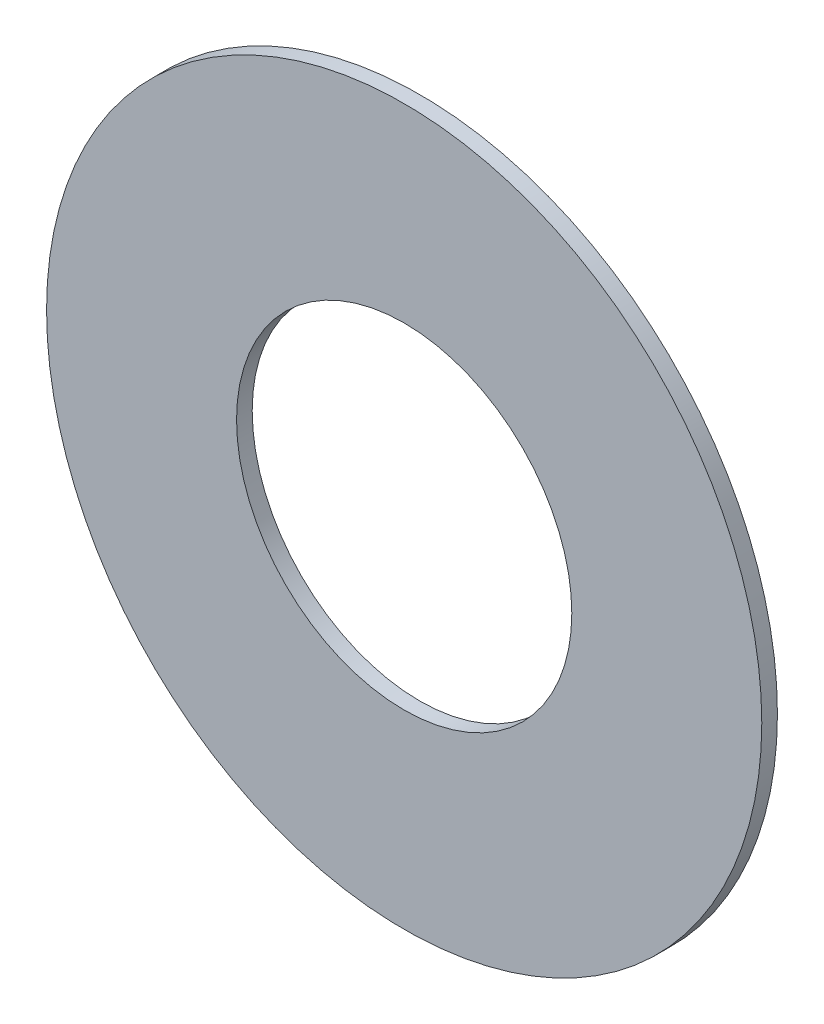
ISO-10303-21;
HEADER;
FILE_DESCRIPTION(('STEP AP214'),'2;1');
FILE_NAME('part.step','',(''),(''),'','','');
FILE_SCHEMA(('AUTOMOTIVE_DESIGN { 1 0 10303 214 1 1 1 1 }'));
ENDSEC;
DATA;
#1=APPLICATION_CONTEXT('core data for automotive mechanical design processes');
#2=APPLICATION_PROTOCOL_DEFINITION('international standard','automotive_design',2000,#1);
#3=PRODUCT_CONTEXT('',#1,'mechanical');
#4=PRODUCT('Part','Part','',(#3));
#5=PRODUCT_RELATED_PRODUCT_CATEGORY('part','',(#4));
#6=PRODUCT_DEFINITION_FORMATION('','',#4);
#7=PRODUCT_DEFINITION_CONTEXT('part definition',#1,'design');
#8=PRODUCT_DEFINITION('design','',#6,#7);
#9=PRODUCT_DEFINITION_SHAPE('','',#8);
#10=(LENGTH_UNIT() NAMED_UNIT(*) SI_UNIT(.MILLI.,.METRE.));
#11=(NAMED_UNIT(*) PLANE_ANGLE_UNIT() SI_UNIT($,.RADIAN.));
#12=(NAMED_UNIT(*) SI_UNIT($,.STERADIAN.) SOLID_ANGLE_UNIT());
#13=UNCERTAINTY_MEASURE_WITH_UNIT(LENGTH_MEASURE(1.E-05),#10,'distance_accuracy_value','');
#14=(GEOMETRIC_REPRESENTATION_CONTEXT(3) GLOBAL_UNCERTAINTY_ASSIGNED_CONTEXT((#13)) GLOBAL_UNIT_ASSIGNED_CONTEXT((#10,
#11,#12)) REPRESENTATION_CONTEXT('',''));
#15=CARTESIAN_POINT('',(0.,0.,0.));
#16=DIRECTION('',(0.,0.,1.));
#17=DIRECTION('',(1.,0.,0.));
#18=AXIS2_PLACEMENT_3D('',#15,#16,#17);
#19=CARTESIAN_POINT('',(155.448,-72.644,-0.045));
#20=DIRECTION('',(0.,0.,-1.));
#21=DIRECTION('',(0.,-1.,0.));
#22=AXIS2_PLACEMENT_3D('',#19,#20,#21);
#23=CYLINDRICAL_SURFACE('',#22,0.375);
#24=CARTESIAN_POINT('',(155.448,-72.644,1.67));
#25=DIRECTION('',(0.,0.,-1.));
#26=DIRECTION('',(0.,-1.,0.));
#27=AXIS2_PLACEMENT_3D('',#24,#25,#26);
#28=CIRCLE('',#27,0.375);
#29=CARTESIAN_POINT('',(155.448,-73.019,1.67));
#30=VERTEX_POINT('',#29);
#31=EDGE_CURVE('E25',#30,#30,#28,.T.);
#32=ORIENTED_EDGE('',*,*,#31,.T.);
#33=DIRECTION('',(0.,0.,1.));
#34=VECTOR('',#33,1.);
#35=CARTESIAN_POINT('',(155.448,-73.019,-0.045));
#36=LINE('',#35,#34);
#37=CARTESIAN_POINT('',(155.448,-73.019,1.705));
#38=VERTEX_POINT('',#37);
#39=EDGE_CURVE('E11',#30,#38,#36,.T.);
#40=ORIENTED_EDGE('',*,*,#39,.T.);
#41=CARTESIAN_POINT('',(155.448,-72.644,1.705));
#42=DIRECTION('',(0.,0.,-1.));
#43=DIRECTION('',(0.,-1.,0.));
#44=AXIS2_PLACEMENT_3D('',#41,#42,#43);
#45=CIRCLE('',#44,0.375);
#46=EDGE_CURVE('E67',#38,#38,#45,.T.);
#47=ORIENTED_EDGE('',*,*,#46,.F.);
#48=ORIENTED_EDGE('',*,*,#39,.F.);
#49=EDGE_LOOP('',(#32,#40,#47,#48));
#50=FACE_BOUND('',#49,.T.);
#51=ADVANCED_FACE('F17',(#50),#23,.F.);
#52=CARTESIAN_POINT('',(155.448,-72.644,1.67));
#53=DIRECTION('',(0.,0.,1.));
#54=DIRECTION('',(1.,0.,0.));
#55=AXIS2_PLACEMENT_3D('',#52,#53,#54);
#56=PLANE('',#55);
#57=ORIENTED_EDGE('',*,*,#31,.F.);
#58=EDGE_LOOP('',(#57));
#59=FACE_BOUND('',#58,.T.);
#60=CARTESIAN_POINT('',(155.448,-72.644,1.67));
#61=DIRECTION('',(0.,0.,1.));
#62=DIRECTION('',(1.,0.,0.));
#63=AXIS2_PLACEMENT_3D('',#60,#61,#62);
#64=CIRCLE('',#63,0.8);
#65=CARTESIAN_POINT('',(156.248,-72.644,1.67));
#66=VERTEX_POINT('',#65);
#67=EDGE_CURVE('E56',#66,#66,#64,.T.);
#68=ORIENTED_EDGE('',*,*,#67,.F.);
#69=EDGE_LOOP('',(#68));
#70=FACE_BOUND('',#69,.T.);
#71=ADVANCED_FACE('F76',(#59,#70),#56,.F.);
#72=CARTESIAN_POINT('',(155.448,-72.644,1.705));
#73=DIRECTION('',(0.,0.,1.));
#74=DIRECTION('',(1.,0.,0.));
#75=AXIS2_PLACEMENT_3D('',#72,#73,#74);
#76=PLANE('',#75);
#77=ORIENTED_EDGE('',*,*,#46,.T.);
#78=EDGE_LOOP('',(#77));
#79=FACE_BOUND('',#78,.T.);
#80=CARTESIAN_POINT('',(155.448,-72.644,1.705));
#81=DIRECTION('',(0.,0.,1.));
#82=DIRECTION('',(1.,0.,0.));
#83=AXIS2_PLACEMENT_3D('',#80,#81,#82);
#84=CIRCLE('',#83,0.8);
#85=CARTESIAN_POINT('',(156.248,-72.644,1.705));
#86=VERTEX_POINT('',#85);
#87=EDGE_CURVE('E54',#86,#86,#84,.T.);
#88=ORIENTED_EDGE('',*,*,#87,.T.);
#89=EDGE_LOOP('',(#88));
#90=FACE_BOUND('',#89,.T.);
#91=ADVANCED_FACE('F60',(#79,#90),#76,.T.);
#92=CARTESIAN_POINT('',(155.448,-72.644,1.67));
#93=DIRECTION('',(0.,0.,1.));
#94=DIRECTION('',(1.,0.,0.));
#95=AXIS2_PLACEMENT_3D('',#92,#93,#94);
#96=CYLINDRICAL_SURFACE('',#95,0.8);
#97=ORIENTED_EDGE('',*,*,#87,.F.);
#98=DIRECTION('',(0.,0.,1.));
#99=VECTOR('',#98,1.);
#100=CARTESIAN_POINT('',(156.248,-72.644,1.67));
#101=LINE('',#100,#99);
#102=EDGE_CURVE('E51',#66,#86,#101,.T.);
#103=ORIENTED_EDGE('',*,*,#102,.F.);
#104=ORIENTED_EDGE('',*,*,#67,.T.);
#105=ORIENTED_EDGE('',*,*,#102,.T.);
#106=EDGE_LOOP('',(#97,#103,#104,#105));
#107=FACE_BOUND('',#106,.T.);
#108=ADVANCED_FACE('F53',(#107),#96,.T.);
#109=CLOSED_SHELL('',(#51,#71,#91,#108));
#110=MANIFOLD_SOLID_BREP('B1',#109);
#111=ADVANCED_BREP_SHAPE_REPRESENTATION('',(#18,#110),#14);
#112=SHAPE_DEFINITION_REPRESENTATION(#9,#111);
ENDSEC;
END-ISO-10303-21;
